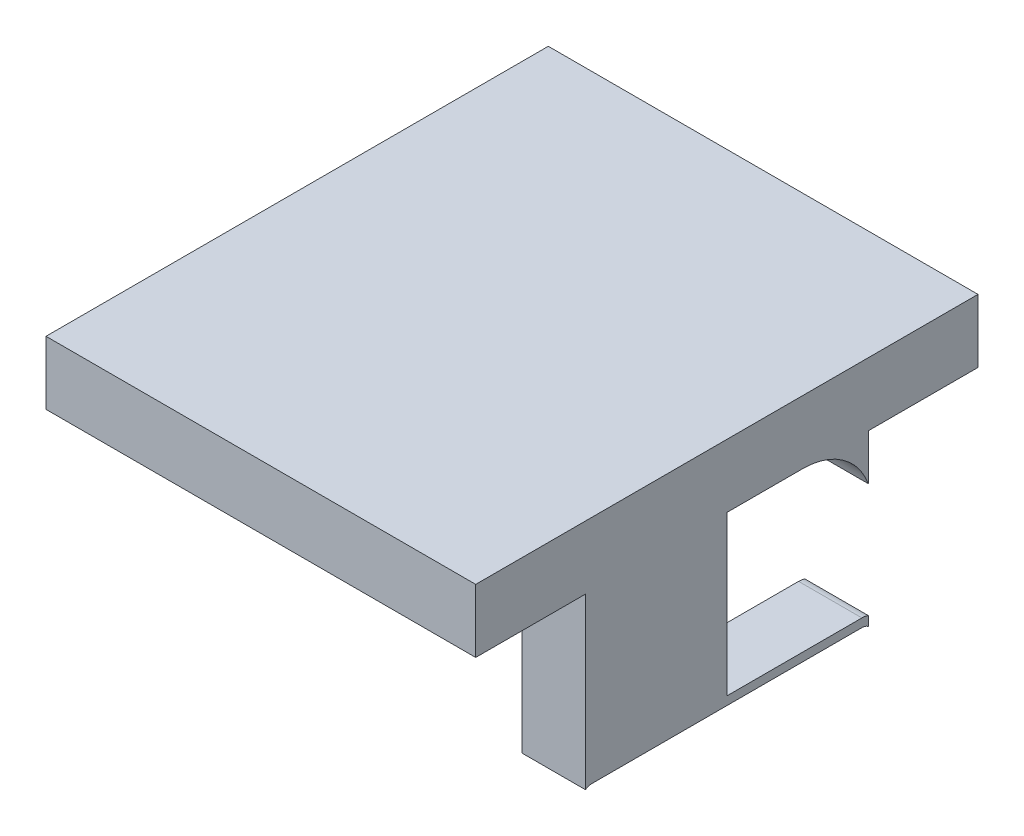
ISO-10303-21;
HEADER;
FILE_DESCRIPTION(('STEP AP214'),'2;1');
FILE_NAME('part.step','',(''),(''),'','','');
FILE_SCHEMA(('AUTOMOTIVE_DESIGN { 1 0 10303 214 1 1 1 1 }'));
ENDSEC;
DATA;
#1=APPLICATION_CONTEXT('core data for automotive mechanical design processes');
#2=APPLICATION_PROTOCOL_DEFINITION('international standard','automotive_design',2000,#1);
#3=PRODUCT_CONTEXT('',#1,'mechanical');
#4=PRODUCT('Part','Part','',(#3));
#5=PRODUCT_RELATED_PRODUCT_CATEGORY('part','',(#4));
#6=PRODUCT_DEFINITION_FORMATION('','',#4);
#7=PRODUCT_DEFINITION_CONTEXT('part definition',#1,'design');
#8=PRODUCT_DEFINITION('design','',#6,#7);
#9=PRODUCT_DEFINITION_SHAPE('','',#8);
#10=(LENGTH_UNIT() NAMED_UNIT(*) SI_UNIT(.MILLI.,.METRE.));
#11=(NAMED_UNIT(*) PLANE_ANGLE_UNIT() SI_UNIT($,.RADIAN.));
#12=(NAMED_UNIT(*) SI_UNIT($,.STERADIAN.) SOLID_ANGLE_UNIT());
#13=UNCERTAINTY_MEASURE_WITH_UNIT(LENGTH_MEASURE(1.E-05),#10,'distance_accuracy_value','');
#14=(GEOMETRIC_REPRESENTATION_CONTEXT(3) GLOBAL_UNCERTAINTY_ASSIGNED_CONTEXT((#13)) GLOBAL_UNIT_ASSIGNED_CONTEXT((#10,
#11,#12)) REPRESENTATION_CONTEXT('',''));
#15=CARTESIAN_POINT('',(0.,0.,0.));
#16=DIRECTION('',(0.,0.,1.));
#17=DIRECTION('',(1.,0.,0.));
#18=AXIS2_PLACEMENT_3D('',#15,#16,#17);
#19=CARTESIAN_POINT('',(-172.469724021272,-66.6233671005223,0.));
#20=DIRECTION('',(0.,1.,0.));
#21=DIRECTION('',(0.,0.,1.));
#22=AXIS2_PLACEMENT_3D('',#19,#20,#21);
#23=PLANE('',#22);
#24=DIRECTION('',(-1.,0.,0.));
#25=VECTOR('',#24,1.);
#26=CARTESIAN_POINT('',(5.4091140287146E-13,-66.6233671005223,-32.4806452321634));
#27=LINE('',#26,#25);
#28=CARTESIAN_POINT('',(-164.684562907065,-66.6233671005223,-32.4806452321661));
#29=VERTEX_POINT('',#28);
#30=CARTESIAN_POINT('',(-167.184562907065,-66.6233671005223,-32.4806452321661));
#31=VERTEX_POINT('',#30);
#32=EDGE_CURVE('E232',#29,#31,#27,.T.);
#33=ORIENTED_EDGE('',*,*,#32,.F.);
#34=DIRECTION('',(0.,0.,1.));
#35=VECTOR('',#34,1.);
#36=CARTESIAN_POINT('',(-164.684562907065,-66.6233671005223,0.));
#37=LINE('',#36,#35);
#38=CARTESIAN_POINT('',(-164.684562907065,-66.6233671005223,-33.4806452321661));
#39=VERTEX_POINT('',#38);
#40=EDGE_CURVE('E245',#39,#29,#37,.T.);
#41=ORIENTED_EDGE('',*,*,#40,.F.);
#42=DIRECTION('',(1.,0.,0.));
#43=VECTOR('',#42,1.);
#44=CARTESIAN_POINT('',(0.,-66.6233671005223,-33.4806452321661));
#45=LINE('',#44,#43);
#46=CARTESIAN_POINT('',(-166.184562907065,-66.6233671005223,-33.4806452321661));
#47=VERTEX_POINT('',#46);
#48=EDGE_CURVE('E264',#47,#39,#45,.T.);
#49=ORIENTED_EDGE('',*,*,#48,.F.);
#50=DIRECTION('',(0.,0.,1.));
#51=VECTOR('',#50,1.);
#52=CARTESIAN_POINT('',(-166.184562907065,-66.6233671005223,0.));
#53=LINE('',#52,#51);
#54=CARTESIAN_POINT('',(-166.184562907065,-66.6233671005223,-34.9806452321661));
#55=VERTEX_POINT('',#54);
#56=EDGE_CURVE('E261',#55,#47,#53,.T.);
#57=ORIENTED_EDGE('',*,*,#56,.F.);
#58=DIRECTION('',(1.,0.,0.));
#59=VECTOR('',#58,1.);
#60=CARTESIAN_POINT('',(0.,-66.6233671005223,-34.9806452321661));
#61=LINE('',#60,#59);
#62=CARTESIAN_POINT('',(-167.184562907065,-66.6233671005223,-34.9806452321661));
#63=VERTEX_POINT('',#62);
#64=EDGE_CURVE('E258',#63,#55,#61,.T.);
#65=ORIENTED_EDGE('',*,*,#64,.F.);
#66=DIRECTION('',(0.,0.,-1.));
#67=VECTOR('',#66,1.);
#68=CARTESIAN_POINT('',(-167.184562907065,-66.6233671005223,0.));
#69=LINE('',#68,#67);
#70=EDGE_CURVE('E235',#31,#63,#69,.T.);
#71=ORIENTED_EDGE('',*,*,#70,.F.);
#72=EDGE_LOOP('',(#33,#41,#49,#57,#65,#71));
#73=FACE_BOUND('',#72,.T.);
#74=DIRECTION('',(1.,0.,0.));
#75=VECTOR('',#74,1.);
#76=CARTESIAN_POINT('',(-172.469724021272,-66.6233671005223,-30.8806452321661));
#77=LINE('',#76,#75);
#78=CARTESIAN_POINT('',(-168.034562907065,-66.6233671005223,-30.8806452321661));
#79=VERTEX_POINT('',#78);
#80=CARTESIAN_POINT('',(-157.854562907065,-66.6233671005223,-30.8806452321661));
#81=VERTEX_POINT('',#80);
#82=EDGE_CURVE('E317',#79,#81,#77,.T.);
#83=ORIENTED_EDGE('',*,*,#82,.F.);
#84=DIRECTION('',(0.,0.,1.));
#85=VECTOR('',#84,1.);
#86=CARTESIAN_POINT('',(-168.034562907065,-66.6233671005223,0.));
#87=LINE('',#86,#85);
#88=CARTESIAN_POINT('',(-168.034562907065,-66.6233671005223,-42.7806452321661));
#89=VERTEX_POINT('',#88);
#90=EDGE_CURVE('E286',#89,#79,#87,.T.);
#91=ORIENTED_EDGE('',*,*,#90,.F.);
#92=DIRECTION('',(1.,0.,0.));
#93=VECTOR('',#92,1.);
#94=CARTESIAN_POINT('',(-172.469724021272,-66.6233671005223,-42.7806452321661));
#95=LINE('',#94,#93);
#96=CARTESIAN_POINT('',(-157.854562907065,-66.6233671005223,-42.7806452321661));
#97=VERTEX_POINT('',#96);
#98=EDGE_CURVE('E391',#89,#97,#95,.T.);
#99=ORIENTED_EDGE('',*,*,#98,.T.);
#100=DIRECTION('',(0.,0.,1.));
#101=VECTOR('',#100,1.);
#102=CARTESIAN_POINT('',(-157.854562907065,-66.6233671005223,0.));
#103=LINE('',#102,#101);
#104=CARTESIAN_POINT('',(-157.854562907065,-66.6233671005223,-40.1806452321661));
#105=VERTEX_POINT('',#104);
#106=EDGE_CURVE('E339',#97,#105,#103,.T.);
#107=ORIENTED_EDGE('',*,*,#106,.T.);
#108=DIRECTION('',(1.,0.,0.));
#109=VECTOR('',#108,1.);
#110=CARTESIAN_POINT('',(-172.469724021272,-66.6233671005223,-40.1806452321661));
#111=LINE('',#110,#109);
#112=CARTESIAN_POINT('',(-159.354562907065,-66.6233671005223,-40.1806452321661));
#113=VERTEX_POINT('',#112);
#114=EDGE_CURVE('E329',#113,#105,#111,.T.);
#115=ORIENTED_EDGE('',*,*,#114,.F.);
#116=DIRECTION('',(0.,0.,-1.));
#117=VECTOR('',#116,1.);
#118=CARTESIAN_POINT('',(-159.354562907065,-66.6233671005223,12.0823331861834));
#119=LINE('',#118,#117);
#120=CARTESIAN_POINT('',(-159.354562907065,-66.6233671005223,-38.6306452321661));
#121=VERTEX_POINT('',#120);
#122=EDGE_CURVE('E43',#121,#113,#119,.T.);
#123=ORIENTED_EDGE('',*,*,#122,.F.);
#124=DIRECTION('',(1.,0.,0.));
#125=VECTOR('',#124,1.);
#126=CARTESIAN_POINT('',(-172.469724021272,-66.6233671005223,-38.6306452321661));
#127=LINE('',#126,#125);
#128=CARTESIAN_POINT('',(-157.854562907065,-66.6233671005223,-38.6306452321661));
#129=VERTEX_POINT('',#128);
#130=EDGE_CURVE('E333',#121,#129,#127,.T.);
#131=ORIENTED_EDGE('',*,*,#130,.T.);
#132=CARTESIAN_POINT('',(-157.854562907065,-66.6233671005223,-36.8306452321661));
#133=VERTEX_POINT('',#132);
#134=EDGE_CURVE('E334',#129,#133,#103,.T.);
#135=ORIENTED_EDGE('',*,*,#134,.T.);
#136=DIRECTION('',(1.,0.,0.));
#137=VECTOR('',#136,1.);
#138=CARTESIAN_POINT('',(-172.469724021272,-66.6233671005223,-36.8306452321661));
#139=LINE('',#138,#137);
#140=CARTESIAN_POINT('',(-159.354562907065,-66.6233671005223,-36.8306452321661));
#141=VERTEX_POINT('',#140);
#142=EDGE_CURVE('E337',#141,#133,#139,.T.);
#143=ORIENTED_EDGE('',*,*,#142,.F.);
#144=CARTESIAN_POINT('',(-159.354562907065,-66.6233671005223,-33.4806452321661));
#145=VERTEX_POINT('',#144);
#146=EDGE_CURVE('E11',#145,#141,#119,.T.);
#147=ORIENTED_EDGE('',*,*,#146,.F.);
#148=DIRECTION('',(1.,0.,0.));
#149=VECTOR('',#148,1.);
#150=CARTESIAN_POINT('',(-172.469724021272,-66.6233671005223,-33.4806452321661));
#151=LINE('',#150,#149);
#152=CARTESIAN_POINT('',(-157.854562907065,-66.6233671005223,-33.4806452321661));
#153=VERTEX_POINT('',#152);
#154=EDGE_CURVE('E386',#145,#153,#151,.T.);
#155=ORIENTED_EDGE('',*,*,#154,.T.);
#156=EDGE_CURVE('E338',#153,#81,#103,.T.);
#157=ORIENTED_EDGE('',*,*,#156,.T.);
#158=EDGE_LOOP('',(#83,#91,#99,#107,#115,#123,#131,#135,#143,#147,#155,#157));
#159=FACE_BOUND('',#158,.T.);
#160=DIRECTION('',(1.,0.,0.));
#161=VECTOR('',#160,1.);
#162=CARTESIAN_POINT('',(-1.1429925126418E-13,-66.6233671005223,-41.1806452321666));
#163=LINE('',#162,#161);
#164=CARTESIAN_POINT('',(-161.954562907065,-66.6233671005223,-41.1806452321662));
#165=VERTEX_POINT('',#164);
#166=CARTESIAN_POINT('',(-159.354562907065,-66.6233671005223,-41.1806452321662));
#167=VERTEX_POINT('',#166);
#168=EDGE_CURVE('E231',#165,#167,#163,.T.);
#169=ORIENTED_EDGE('',*,*,#168,.F.);
#170=DIRECTION('',(0.,0.,-1.));
#171=VECTOR('',#170,1.);
#172=CARTESIAN_POINT('',(-161.954562907065,-66.6233671005223,0.));
#173=LINE('',#172,#171);
#174=CARTESIAN_POINT('',(-161.954562907065,-66.6233671005223,-40.2806452321661));
#175=VERTEX_POINT('',#174);
#176=EDGE_CURVE('E228',#175,#165,#173,.T.);
#177=ORIENTED_EDGE('',*,*,#176,.F.);
#178=DIRECTION('',(-1.,0.,0.));
#179=VECTOR('',#178,1.);
#180=CARTESIAN_POINT('',(0.,-66.6233671005223,-40.2806452321661));
#181=LINE('',#180,#179);
#182=CARTESIAN_POINT('',(-159.354562907065,-66.6233671005223,-40.2806452321661));
#183=VERTEX_POINT('',#182);
#184=EDGE_CURVE('E59',#183,#175,#181,.T.);
#185=ORIENTED_EDGE('',*,*,#184,.F.);
#186=DIRECTION('',(0.,0.,1.));
#187=VECTOR('',#186,1.);
#188=CARTESIAN_POINT('',(-159.354562907065,-66.6233671005223,0.));
#189=LINE('',#188,#187);
#190=EDGE_CURVE('E54',#167,#183,#189,.T.);
#191=ORIENTED_EDGE('',*,*,#190,.F.);
#192=EDGE_LOOP('',(#169,#177,#185,#191));
#193=FACE_BOUND('',#192,.T.);
#194=ADVANCED_FACE('F39',(#73,#159,#193),#23,.F.);
#195=CARTESIAN_POINT('',(-159.354562907065,-18.3232666768886,12.0823331861834));
#196=DIRECTION('',(-1.,0.,0.));
#197=DIRECTION('',(0.,0.,1.));
#198=AXIS2_PLACEMENT_3D('',#195,#196,#197);
#199=PLANE('',#198);
#200=DIRECTION('',(0.,-1.,0.));
#201=VECTOR('',#200,1.);
#202=CARTESIAN_POINT('',(-159.354562907065,0.,-33.4806452321661));
#203=LINE('',#202,#201);
#204=CARTESIAN_POINT('',(-159.354562907065,-70.6367554463235,-33.4806452321661));
#205=VERTEX_POINT('',#204);
#206=EDGE_CURVE('E307',#145,#205,#203,.T.);
#207=ORIENTED_EDGE('',*,*,#206,.F.);
#208=ORIENTED_EDGE('',*,*,#146,.T.);
#209=DIRECTION('',(0.,-1.,0.));
#210=VECTOR('',#209,1.);
#211=CARTESIAN_POINT('',(-159.354562907065,0.,-36.8306452321661));
#212=LINE('',#211,#210);
#213=CARTESIAN_POINT('',(-159.354562907065,-70.3867554463235,-36.8306452321661));
#214=VERTEX_POINT('',#213);
#215=EDGE_CURVE('E361',#141,#214,#212,.T.);
#216=ORIENTED_EDGE('',*,*,#215,.T.);
#217=DIRECTION('',(0.,0.,1.));
#218=VECTOR('',#217,1.);
#219=CARTESIAN_POINT('',(-159.354562907065,-70.3867554463234,1.52626946338219E-13));
#220=LINE('',#219,#218);
#221=CARTESIAN_POINT('',(-159.354562907065,-70.3867554463235,-40.0306452321661));
#222=VERTEX_POINT('',#221);
#223=EDGE_CURVE('E343',#222,#214,#220,.T.);
#224=ORIENTED_EDGE('',*,*,#223,.F.);
#225=CARTESIAN_POINT('',(-159.354562907065,-70.8367554463235,-40.0306452321661));
#226=DIRECTION('',(-1.,0.,0.));
#227=DIRECTION('',(0.,0.,1.));
#228=AXIS2_PLACEMENT_3D('',#225,#226,#227);
#229=CIRCLE('',#228,0.449999999999996);
#230=CARTESIAN_POINT('',(-159.354562907065,-70.4124913776115,-40.1806452321661));
#231=VERTEX_POINT('',#230);
#232=EDGE_CURVE('E356',#231,#222,#229,.F.);
#233=ORIENTED_EDGE('',*,*,#232,.F.);
#234=DIRECTION('',(0.,-1.,0.));
#235=VECTOR('',#234,1.);
#236=CARTESIAN_POINT('',(-159.354562907065,0.,-40.1806452321661));
#237=LINE('',#236,#235);
#238=CARTESIAN_POINT('',(-159.354562907065,-70.6367554463235,-40.1806452321661));
#239=VERTEX_POINT('',#238);
#240=EDGE_CURVE('E311',#231,#239,#237,.T.);
#241=ORIENTED_EDGE('',*,*,#240,.T.);
#242=CARTESIAN_POINT('',(-159.354562907065,-70.8367554463235,-40.0306452321661));
#243=DIRECTION('',(-1.,0.,0.));
#244=DIRECTION('',(0.,0.,1.));
#245=AXIS2_PLACEMENT_3D('',#242,#243,#244);
#246=CIRCLE('',#245,0.25);
#247=CARTESIAN_POINT('',(-159.354562907065,-70.5867554463235,-40.0306452321661));
#248=VERTEX_POINT('',#247);
#249=EDGE_CURVE('E378',#239,#248,#246,.F.);
#250=ORIENTED_EDGE('',*,*,#249,.T.);
#251=DIRECTION('',(0.,0.,1.));
#252=VECTOR('',#251,1.);
#253=CARTESIAN_POINT('',(-159.354562907065,-70.5867554463235,0.));
#254=LINE('',#253,#252);
#255=CARTESIAN_POINT('',(-159.354562907065,-70.5867554463235,-33.6306452321661));
#256=VERTEX_POINT('',#255);
#257=EDGE_CURVE('E375',#248,#256,#254,.T.);
#258=ORIENTED_EDGE('',*,*,#257,.T.);
#259=CARTESIAN_POINT('',(-159.354562907065,-70.8367554463235,-33.6306452321661));
#260=DIRECTION('',(-1.,0.,0.));
#261=DIRECTION('',(0.,0.,1.));
#262=AXIS2_PLACEMENT_3D('',#259,#260,#261);
#263=CIRCLE('',#262,0.249999999999993);
#264=EDGE_CURVE('E370',#256,#205,#263,.F.);
#265=ORIENTED_EDGE('',*,*,#264,.T.);
#266=EDGE_LOOP('',(#207,#208,#216,#224,#233,#241,#250,#258,#265));
#267=FACE_BOUND('',#266,.T.);
#268=ADVANCED_FACE('F41',(#267),#199,.T.);
#269=CARTESIAN_POINT('',(-159.354562907065,-68.2733671005223,-38.6306452321661));
#270=DIRECTION('',(-1.,0.,0.));
#271=DIRECTION('',(0.,0.,1.));
#272=AXIS2_PLACEMENT_3D('',#269,#270,#271);
#273=CIRCLE('',#272,1.65);
#274=CARTESIAN_POINT('',(-159.354562907065,-67.707681675573,-40.1806452321661));
#275=VERTEX_POINT('',#274);
#276=EDGE_CURVE('E364',#275,#121,#273,.F.);
#277=ORIENTED_EDGE('',*,*,#276,.T.);
#278=ORIENTED_EDGE('',*,*,#122,.T.);
#279=DIRECTION('',(0.,-1.,0.));
#280=VECTOR('',#279,1.);
#281=CARTESIAN_POINT('',(-159.354562907065,0.,-40.1806452321661));
#282=LINE('',#281,#280);
#283=EDGE_CURVE('E367',#113,#275,#282,.T.);
#284=ORIENTED_EDGE('',*,*,#283,.T.);
#285=EDGE_LOOP('',(#277,#278,#284));
#286=FACE_BOUND('',#285,.T.);
#287=ADVANCED_FACE('F479',(#286),#199,.T.);
#288=CARTESIAN_POINT('',(-172.469724021272,-70.8367554463235,-40.0306452321661));
#289=DIRECTION('',(1.,0.,0.));
#290=DIRECTION('',(0.,0.,-1.));
#291=AXIS2_PLACEMENT_3D('',#288,#289,#290);
#292=CYLINDRICAL_SURFACE('',#291,0.25);
#293=ORIENTED_EDGE('',*,*,#249,.F.);
#294=DIRECTION('',(1.,0.,0.));
#295=VECTOR('',#294,1.);
#296=CARTESIAN_POINT('',(-172.469724021272,-70.6367554463235,-40.1806452321661));
#297=LINE('',#296,#295);
#298=CARTESIAN_POINT('',(-157.854562907065,-70.6367554463235,-40.1806452321661));
#299=VERTEX_POINT('',#298);
#300=EDGE_CURVE('E290',#239,#299,#297,.T.);
#301=ORIENTED_EDGE('',*,*,#300,.T.);
#302=CARTESIAN_POINT('',(-157.854562907065,-70.8367554463235,-40.0306452321661));
#303=DIRECTION('',(1.,0.,0.));
#304=DIRECTION('',(0.,0.,-1.));
#305=AXIS2_PLACEMENT_3D('',#302,#303,#304);
#306=CIRCLE('',#305,0.25);
#307=CARTESIAN_POINT('',(-157.854562907065,-70.5867554463235,-40.0306452321661));
#308=VERTEX_POINT('',#307);
#309=EDGE_CURVE('E353',#299,#308,#306,.T.);
#310=ORIENTED_EDGE('',*,*,#309,.T.);
#311=DIRECTION('',(1.,0.,0.));
#312=VECTOR('',#311,1.);
#313=CARTESIAN_POINT('',(-172.469724021272,-70.5867554463235,-40.0306452321661));
#314=LINE('',#313,#312);
#315=EDGE_CURVE('E303',#248,#308,#314,.T.);
#316=ORIENTED_EDGE('',*,*,#315,.F.);
#317=EDGE_LOOP('',(#293,#301,#310,#316));
#318=FACE_BOUND('',#317,.T.);
#319=ADVANCED_FACE('F401',(#318),#292,.F.);
#320=CARTESIAN_POINT('',(-172.469724021272,-70.5867554463235,0.));
#321=DIRECTION('',(0.,1.,0.));
#322=DIRECTION('',(0.,0.,1.));
#323=AXIS2_PLACEMENT_3D('',#320,#321,#322);
#324=PLANE('',#323);
#325=ORIENTED_EDGE('',*,*,#257,.F.);
#326=ORIENTED_EDGE('',*,*,#315,.T.);
#327=DIRECTION('',(0.,0.,1.));
#328=VECTOR('',#327,1.);
#329=CARTESIAN_POINT('',(-157.854562907065,-70.5867554463235,0.));
#330=LINE('',#329,#328);
#331=CARTESIAN_POINT('',(-157.854562907065,-70.5867554463235,-33.6306452321661));
#332=VERTEX_POINT('',#331);
#333=EDGE_CURVE('E299',#308,#332,#330,.T.);
#334=ORIENTED_EDGE('',*,*,#333,.T.);
#335=DIRECTION('',(1.,0.,0.));
#336=VECTOR('',#335,1.);
#337=CARTESIAN_POINT('',(-172.469724021272,-70.5867554463235,-33.6306452321661));
#338=LINE('',#337,#336);
#339=EDGE_CURVE('E302',#256,#332,#338,.T.);
#340=ORIENTED_EDGE('',*,*,#339,.F.);
#341=EDGE_LOOP('',(#325,#326,#334,#340));
#342=FACE_BOUND('',#341,.T.);
#343=ADVANCED_FACE('F416',(#342),#324,.F.);
#344=CARTESIAN_POINT('',(-172.469724021272,-70.8367554463235,-33.6306452321661));
#345=DIRECTION('',(1.,0.,0.));
#346=DIRECTION('',(0.,0.,-1.));
#347=AXIS2_PLACEMENT_3D('',#344,#345,#346);
#348=CYLINDRICAL_SURFACE('',#347,0.249999999999993);
#349=ORIENTED_EDGE('',*,*,#264,.F.);
#350=ORIENTED_EDGE('',*,*,#339,.T.);
#351=CARTESIAN_POINT('',(-157.854562907065,-70.8367554463235,-33.6306452321661));
#352=DIRECTION('',(1.,0.,0.));
#353=DIRECTION('',(0.,0.,-1.));
#354=AXIS2_PLACEMENT_3D('',#351,#352,#353);
#355=CIRCLE('',#354,0.249999999999993);
#356=CARTESIAN_POINT('',(-157.854562907065,-70.6367554463235,-33.4806452321661));
#357=VERTEX_POINT('',#356);
#358=EDGE_CURVE('E304',#332,#357,#355,.T.);
#359=ORIENTED_EDGE('',*,*,#358,.T.);
#360=DIRECTION('',(1.,0.,0.));
#361=VECTOR('',#360,1.);
#362=CARTESIAN_POINT('',(-172.469724021272,-70.6367554463235,-33.4806452321661));
#363=LINE('',#362,#361);
#364=EDGE_CURVE('E372',#205,#357,#363,.T.);
#365=ORIENTED_EDGE('',*,*,#364,.F.);
#366=EDGE_LOOP('',(#349,#350,#359,#365));
#367=FACE_BOUND('',#366,.T.);
#368=ADVANCED_FACE('F626',(#367),#348,.F.);
#369=CARTESIAN_POINT('',(-172.469724021272,0.,-33.4806452321661));
#370=DIRECTION('',(0.,0.,1.));
#371=DIRECTION('',(1.,0.,0.));
#372=AXIS2_PLACEMENT_3D('',#369,#370,#371);
#373=PLANE('',#372);
#374=ORIENTED_EDGE('',*,*,#154,.F.);
#375=ORIENTED_EDGE('',*,*,#206,.T.);
#376=ORIENTED_EDGE('',*,*,#364,.T.);
#377=DIRECTION('',(0.,-1.,0.));
#378=VECTOR('',#377,1.);
#379=CARTESIAN_POINT('',(-157.854562907065,0.,-33.4806452321661));
#380=LINE('',#379,#378);
#381=EDGE_CURVE('E308',#153,#357,#380,.T.);
#382=ORIENTED_EDGE('',*,*,#381,.F.);
#383=EDGE_LOOP('',(#374,#375,#376,#382));
#384=FACE_BOUND('',#383,.T.);
#385=ADVANCED_FACE('F631',(#384),#373,.T.);
#386=CARTESIAN_POINT('',(-172.469724021272,0.,-30.8806452321661));
#387=DIRECTION('',(0.,0.,-1.));
#388=DIRECTION('',(-1.,0.,0.));
#389=AXIS2_PLACEMENT_3D('',#386,#387,#388);
#390=PLANE('',#389);
#391=DIRECTION('',(1.,0.,0.));
#392=VECTOR('',#391,1.);
#393=CARTESIAN_POINT('',(-172.469724021272,-65.1233671005223,-30.8806452321661));
#394=LINE('',#393,#392);
#395=CARTESIAN_POINT('',(-168.034562907065,-65.1233671005223,-30.8806452321661));
#396=VERTEX_POINT('',#395);
#397=CARTESIAN_POINT('',(-157.854562907065,-65.1233671005223,-30.8806452321661));
#398=VERTEX_POINT('',#397);
#399=EDGE_CURVE('E316',#396,#398,#394,.T.);
#400=ORIENTED_EDGE('',*,*,#399,.F.);
#401=DIRECTION('',(0.,1.,0.));
#402=VECTOR('',#401,1.);
#403=CARTESIAN_POINT('',(-168.034562907065,0.,-30.8806452321661));
#404=LINE('',#403,#402);
#405=EDGE_CURVE('E294',#79,#396,#404,.T.);
#406=ORIENTED_EDGE('',*,*,#405,.F.);
#407=ORIENTED_EDGE('',*,*,#82,.T.);
#408=DIRECTION('',(0.,1.,0.));
#409=VECTOR('',#408,1.);
#410=CARTESIAN_POINT('',(-157.854562907065,0.,-30.8806452321661));
#411=LINE('',#410,#409);
#412=EDGE_CURVE('E313',#81,#398,#411,.T.);
#413=ORIENTED_EDGE('',*,*,#412,.T.);
#414=EDGE_LOOP('',(#400,#406,#407,#413));
#415=FACE_BOUND('',#414,.T.);
#416=ADVANCED_FACE('F455',(#415),#390,.F.);
#417=CARTESIAN_POINT('',(-172.469724021272,-65.1233671005223,0.));
#418=DIRECTION('',(0.,-1.,0.));
#419=DIRECTION('',(0.,0.,-1.));
#420=AXIS2_PLACEMENT_3D('',#417,#418,#419);
#421=PLANE('',#420);
#422=DIRECTION('',(1.,0.,0.));
#423=VECTOR('',#422,1.);
#424=CARTESIAN_POINT('',(-172.469724021272,-65.1233671005223,-42.7806452321661));
#425=LINE('',#424,#423);
#426=CARTESIAN_POINT('',(-168.034562907065,-65.1233671005223,-42.7806452321661));
#427=VERTEX_POINT('',#426);
#428=CARTESIAN_POINT('',(-157.854562907065,-65.1233671005223,-42.7806452321661));
#429=VERTEX_POINT('',#428);
#430=EDGE_CURVE('E321',#427,#429,#425,.T.);
#431=ORIENTED_EDGE('',*,*,#430,.F.);
#432=DIRECTION('',(0.,0.,-1.));
#433=VECTOR('',#432,1.);
#434=CARTESIAN_POINT('',(-168.034562907065,-65.1233671005223,0.));
#435=LINE('',#434,#433);
#436=EDGE_CURVE('E291',#396,#427,#435,.T.);
#437=ORIENTED_EDGE('',*,*,#436,.F.);
#438=ORIENTED_EDGE('',*,*,#399,.T.);
#439=DIRECTION('',(0.,0.,-1.));
#440=VECTOR('',#439,1.);
#441=CARTESIAN_POINT('',(-157.854562907065,-65.1233671005223,0.));
#442=LINE('',#441,#440);
#443=EDGE_CURVE('E318',#398,#429,#442,.T.);
#444=ORIENTED_EDGE('',*,*,#443,.T.);
#445=EDGE_LOOP('',(#431,#437,#438,#444));
#446=FACE_BOUND('',#445,.T.);
#447=ADVANCED_FACE('F462',(#446),#421,.F.);
#448=CARTESIAN_POINT('',(-172.469724021272,0.,-42.7806452321661));
#449=DIRECTION('',(0.,0.,-1.));
#450=DIRECTION('',(-1.,0.,0.));
#451=AXIS2_PLACEMENT_3D('',#448,#449,#450);
#452=PLANE('',#451);
#453=ORIENTED_EDGE('',*,*,#98,.F.);
#454=DIRECTION('',(0.,1.,0.));
#455=VECTOR('',#454,1.);
#456=CARTESIAN_POINT('',(-168.034562907065,0.,-42.7806452321661));
#457=LINE('',#456,#455);
#458=EDGE_CURVE('E287',#89,#427,#457,.T.);
#459=ORIENTED_EDGE('',*,*,#458,.T.);
#460=ORIENTED_EDGE('',*,*,#430,.T.);
#461=DIRECTION('',(0.,1.,0.));
#462=VECTOR('',#461,1.);
#463=CARTESIAN_POINT('',(-157.854562907065,0.,-42.7806452321661));
#464=LINE('',#463,#462);
#465=EDGE_CURVE('E312',#97,#429,#464,.T.);
#466=ORIENTED_EDGE('',*,*,#465,.F.);
#467=EDGE_LOOP('',(#453,#459,#460,#466));
#468=FACE_BOUND('',#467,.T.);
#469=ADVANCED_FACE('F464',(#468),#452,.T.);
#470=CARTESIAN_POINT('',(-172.469724021272,0.,-40.1806452321661));
#471=DIRECTION('',(0.,0.,1.));
#472=DIRECTION('',(1.,0.,0.));
#473=AXIS2_PLACEMENT_3D('',#470,#471,#472);
#474=PLANE('',#473);
#475=ORIENTED_EDGE('',*,*,#283,.F.);
#476=ORIENTED_EDGE('',*,*,#114,.T.);
#477=DIRECTION('',(0.,-1.,0.));
#478=VECTOR('',#477,1.);
#479=CARTESIAN_POINT('',(-157.854562907065,0.,-40.1806452321661));
#480=LINE('',#479,#478);
#481=CARTESIAN_POINT('',(-157.854562907065,-67.707681675573,-40.1806452321661));
#482=VERTEX_POINT('',#481);
#483=EDGE_CURVE('E325',#105,#482,#480,.T.);
#484=ORIENTED_EDGE('',*,*,#483,.T.);
#485=DIRECTION('',(1.,0.,0.));
#486=VECTOR('',#485,1.);
#487=CARTESIAN_POINT('',(-172.469724021272,-67.707681675573,-40.1806452321661));
#488=LINE('',#487,#486);
#489=EDGE_CURVE('E328',#275,#482,#488,.T.);
#490=ORIENTED_EDGE('',*,*,#489,.F.);
#491=EDGE_LOOP('',(#475,#476,#484,#490));
#492=FACE_BOUND('',#491,.T.);
#493=ADVANCED_FACE('F447',(#492),#474,.F.);
#494=CARTESIAN_POINT('',(-172.469724021272,-68.2733671005223,-38.6306452321661));
#495=DIRECTION('',(1.,0.,0.));
#496=DIRECTION('',(0.,0.,-1.));
#497=AXIS2_PLACEMENT_3D('',#494,#495,#496);
#498=CYLINDRICAL_SURFACE('',#497,1.65);
#499=ORIENTED_EDGE('',*,*,#276,.F.);
#500=ORIENTED_EDGE('',*,*,#489,.T.);
#501=CARTESIAN_POINT('',(-157.854562907065,-68.2733671005223,-38.6306452321661));
#502=DIRECTION('',(1.,0.,0.));
#503=DIRECTION('',(0.,0.,-1.));
#504=AXIS2_PLACEMENT_3D('',#501,#502,#503);
#505=CIRCLE('',#504,1.65);
#506=EDGE_CURVE('E330',#482,#129,#505,.T.);
#507=ORIENTED_EDGE('',*,*,#506,.T.);
#508=ORIENTED_EDGE('',*,*,#130,.F.);
#509=EDGE_LOOP('',(#499,#500,#507,#508));
#510=FACE_BOUND('',#509,.T.);
#511=ADVANCED_FACE('F439',(#510),#498,.F.);
#512=CARTESIAN_POINT('',(-172.469724021272,0.,-36.8306452321661));
#513=DIRECTION('',(0.,0.,1.));
#514=DIRECTION('',(1.,0.,0.));
#515=AXIS2_PLACEMENT_3D('',#512,#513,#514);
#516=PLANE('',#515);
#517=ORIENTED_EDGE('',*,*,#215,.F.);
#518=ORIENTED_EDGE('',*,*,#142,.T.);
#519=DIRECTION('',(0.,-1.,0.));
#520=VECTOR('',#519,1.);
#521=CARTESIAN_POINT('',(-157.854562907065,0.,-36.8306452321661));
#522=LINE('',#521,#520);
#523=CARTESIAN_POINT('',(-157.854562907065,-70.3867554463235,-36.8306452321661));
#524=VERTEX_POINT('',#523);
#525=EDGE_CURVE('E340',#133,#524,#522,.T.);
#526=ORIENTED_EDGE('',*,*,#525,.T.);
#527=DIRECTION('',(1.,0.,0.));
#528=VECTOR('',#527,1.);
#529=CARTESIAN_POINT('',(-172.469724021272,-70.3867554463235,-36.8306452321661));
#530=LINE('',#529,#528);
#531=EDGE_CURVE('E359',#214,#524,#530,.T.);
#532=ORIENTED_EDGE('',*,*,#531,.F.);
#533=EDGE_LOOP('',(#517,#518,#526,#532));
#534=FACE_BOUND('',#533,.T.);
#535=ADVANCED_FACE('F432',(#534),#516,.F.);
#536=CARTESIAN_POINT('',(-172.469724021272,-70.3867554463234,1.52626946338219E-13));
#537=DIRECTION('',(0.,1.,0.));
#538=DIRECTION('',(0.,0.,1.));
#539=AXIS2_PLACEMENT_3D('',#536,#537,#538);
#540=PLANE('',#539);
#541=DIRECTION('',(1.,0.,0.));
#542=VECTOR('',#541,1.);
#543=CARTESIAN_POINT('',(-172.469724021272,-70.3867554463235,-40.0306452321661));
#544=LINE('',#543,#542);
#545=CARTESIAN_POINT('',(-157.854562907065,-70.3867554463235,-40.0306452321661));
#546=VERTEX_POINT('',#545);
#547=EDGE_CURVE('E358',#222,#546,#544,.T.);
#548=ORIENTED_EDGE('',*,*,#547,.F.);
#549=ORIENTED_EDGE('',*,*,#223,.T.);
#550=ORIENTED_EDGE('',*,*,#531,.T.);
#551=DIRECTION('',(0.,0.,1.));
#552=VECTOR('',#551,1.);
#553=CARTESIAN_POINT('',(-157.854562907065,-70.3867554463234,1.52626946338219E-13));
#554=LINE('',#553,#552);
#555=EDGE_CURVE('E324',#546,#524,#554,.T.);
#556=ORIENTED_EDGE('',*,*,#555,.F.);
#557=EDGE_LOOP('',(#548,#549,#550,#556));
#558=FACE_BOUND('',#557,.T.);
#559=ADVANCED_FACE('F426',(#558),#540,.T.);
#560=CARTESIAN_POINT('',(-172.469724021272,-70.8367554463235,-40.0306452321661));
#561=DIRECTION('',(1.,0.,0.));
#562=DIRECTION('',(0.,0.,-1.));
#563=AXIS2_PLACEMENT_3D('',#560,#561,#562);
#564=CYLINDRICAL_SURFACE('',#563,0.449999999999996);
#565=DIRECTION('',(1.,0.,0.));
#566=VECTOR('',#565,1.);
#567=CARTESIAN_POINT('',(-172.469724021272,-70.4124913776115,-40.1806452321661));
#568=LINE('',#567,#566);
#569=CARTESIAN_POINT('',(-157.854562907065,-70.4124913776115,-40.1806452321661));
#570=VERTEX_POINT('',#569);
#571=EDGE_CURVE('E352',#231,#570,#568,.T.);
#572=ORIENTED_EDGE('',*,*,#571,.F.);
#573=ORIENTED_EDGE('',*,*,#232,.T.);
#574=ORIENTED_EDGE('',*,*,#547,.T.);
#575=CARTESIAN_POINT('',(-157.854562907065,-70.8367554463235,-40.0306452321661));
#576=DIRECTION('',(1.,0.,0.));
#577=DIRECTION('',(0.,0.,-1.));
#578=AXIS2_PLACEMENT_3D('',#575,#576,#577);
#579=CIRCLE('',#578,0.449999999999996);
#580=EDGE_CURVE('E346',#570,#546,#579,.T.);
#581=ORIENTED_EDGE('',*,*,#580,.F.);
#582=EDGE_LOOP('',(#572,#573,#574,#581));
#583=FACE_BOUND('',#582,.T.);
#584=ADVANCED_FACE('F423',(#583),#564,.T.);
#585=CARTESIAN_POINT('',(-172.469724021272,0.,-40.1806452321661));
#586=DIRECTION('',(0.,0.,1.));
#587=DIRECTION('',(1.,0.,0.));
#588=AXIS2_PLACEMENT_3D('',#585,#586,#587);
#589=PLANE('',#588);
#590=ORIENTED_EDGE('',*,*,#240,.F.);
#591=ORIENTED_EDGE('',*,*,#571,.T.);
#592=DIRECTION('',(0.,-1.,0.));
#593=VECTOR('',#592,1.);
#594=CARTESIAN_POINT('',(-157.854562907065,0.,-40.1806452321661));
#595=LINE('',#594,#593);
#596=EDGE_CURVE('E349',#570,#299,#595,.T.);
#597=ORIENTED_EDGE('',*,*,#596,.T.);
#598=ORIENTED_EDGE('',*,*,#300,.F.);
#599=EDGE_LOOP('',(#590,#591,#597,#598));
#600=FACE_BOUND('',#599,.T.);
#601=ADVANCED_FACE('F407',(#600),#589,.F.);
#602=CARTESIAN_POINT('',(-157.854562907065,0.,0.));
#603=DIRECTION('',(1.,0.,0.));
#604=DIRECTION('',(0.,0.,-1.));
#605=AXIS2_PLACEMENT_3D('',#602,#603,#604);
#606=PLANE('',#605);
#607=ORIENTED_EDGE('',*,*,#134,.F.);
#608=ORIENTED_EDGE('',*,*,#506,.F.);
#609=ORIENTED_EDGE('',*,*,#483,.F.);
#610=ORIENTED_EDGE('',*,*,#106,.F.);
#611=ORIENTED_EDGE('',*,*,#465,.T.);
#612=ORIENTED_EDGE('',*,*,#443,.F.);
#613=ORIENTED_EDGE('',*,*,#412,.F.);
#614=ORIENTED_EDGE('',*,*,#156,.F.);
#615=ORIENTED_EDGE('',*,*,#381,.T.);
#616=ORIENTED_EDGE('',*,*,#358,.F.);
#617=ORIENTED_EDGE('',*,*,#333,.F.);
#618=ORIENTED_EDGE('',*,*,#309,.F.);
#619=ORIENTED_EDGE('',*,*,#596,.F.);
#620=ORIENTED_EDGE('',*,*,#580,.T.);
#621=ORIENTED_EDGE('',*,*,#555,.T.);
#622=ORIENTED_EDGE('',*,*,#525,.F.);
#623=EDGE_LOOP('',(#607,#608,#609,#610,#611,#612,#613,#614,#615,#616,#617,#618,#619,#620,#621,#622));
#624=FACE_BOUND('',#623,.T.);
#625=ADVANCED_FACE('F412',(#624),#606,.T.);
#626=CARTESIAN_POINT('',(-168.034562907065,-108.2104113613,78.6693547678341));
#627=DIRECTION('',(-1.,0.,0.));
#628=DIRECTION('',(0.,0.,-1.));
#629=AXIS2_PLACEMENT_3D('',#626,#627,#628);
#630=PLANE('',#629);
#631=ORIENTED_EDGE('',*,*,#458,.F.);
#632=ORIENTED_EDGE('',*,*,#90,.T.);
#633=ORIENTED_EDGE('',*,*,#405,.T.);
#634=ORIENTED_EDGE('',*,*,#436,.T.);
#635=EDGE_LOOP('',(#631,#632,#633,#634));
#636=FACE_BOUND('',#635,.T.);
#637=ADVANCED_FACE('F460',(#636),#630,.T.);
#638=CARTESIAN_POINT('',(5.4091140287146E-13,-67.6233671005223,-32.4806452321634));
#639=DIRECTION('',(0.,0.,-1.));
#640=DIRECTION('',(-1.,0.,0.));
#641=AXIS2_PLACEMENT_3D('',#638,#639,#640);
#642=PLANE('',#641);
#643=ORIENTED_EDGE('',*,*,#32,.T.);
#644=DIRECTION('',(0.,1.,0.));
#645=VECTOR('',#644,1.);
#646=CARTESIAN_POINT('',(-167.184562907065,-67.6233671005223,-32.4806452321661));
#647=LINE('',#646,#645);
#648=CARTESIAN_POINT('',(-167.184562907065,-67.6233671005223,-32.4806452321661));
#649=VERTEX_POINT('',#648);
#650=EDGE_CURVE('E283',#649,#31,#647,.T.);
#651=ORIENTED_EDGE('',*,*,#650,.F.);
#652=DIRECTION('',(-1.,0.,0.));
#653=VECTOR('',#652,1.);
#654=CARTESIAN_POINT('',(5.4091140287146E-13,-67.6233671005223,-32.4806452321634));
#655=LINE('',#654,#653);
#656=CARTESIAN_POINT('',(-164.684562907065,-67.6233671005223,-32.4806452321661));
#657=VERTEX_POINT('',#656);
#658=EDGE_CURVE('E241',#657,#649,#655,.T.);
#659=ORIENTED_EDGE('',*,*,#658,.F.);
#660=DIRECTION('',(0.,1.,0.));
#661=VECTOR('',#660,1.);
#662=CARTESIAN_POINT('',(-164.684562907065,-67.6233671005223,-32.4806452321661));
#663=LINE('',#662,#661);
#664=EDGE_CURVE('E254',#657,#29,#663,.T.);
#665=ORIENTED_EDGE('',*,*,#664,.T.);
#666=EDGE_LOOP('',(#643,#651,#659,#665));
#667=FACE_BOUND('',#666,.T.);
#668=ADVANCED_FACE('F501',(#667),#642,.F.);
#669=CARTESIAN_POINT('',(-167.184562907065,-67.6233671005223,0.));
#670=DIRECTION('',(1.,0.,0.));
#671=DIRECTION('',(0.,0.,-1.));
#672=AXIS2_PLACEMENT_3D('',#669,#670,#671);
#673=PLANE('',#672);
#674=ORIENTED_EDGE('',*,*,#70,.T.);
#675=DIRECTION('',(0.,1.,0.));
#676=VECTOR('',#675,1.);
#677=CARTESIAN_POINT('',(-167.184562907065,-67.6233671005223,-34.9806452321661));
#678=LINE('',#677,#676);
#679=CARTESIAN_POINT('',(-167.184562907065,-67.6233671005223,-34.9806452321661));
#680=VERTEX_POINT('',#679);
#681=EDGE_CURVE('E280',#680,#63,#678,.T.);
#682=ORIENTED_EDGE('',*,*,#681,.F.);
#683=DIRECTION('',(0.,0.,-1.));
#684=VECTOR('',#683,1.);
#685=CARTESIAN_POINT('',(-167.184562907065,-67.6233671005223,0.));
#686=LINE('',#685,#684);
#687=EDGE_CURVE('E244',#649,#680,#686,.T.);
#688=ORIENTED_EDGE('',*,*,#687,.F.);
#689=ORIENTED_EDGE('',*,*,#650,.T.);
#690=EDGE_LOOP('',(#674,#682,#688,#689));
#691=FACE_BOUND('',#690,.T.);
#692=ADVANCED_FACE('F504',(#691),#673,.F.);
#693=CARTESIAN_POINT('',(0.,-67.6233671005223,-34.9806452321661));
#694=DIRECTION('',(0.,0.,1.));
#695=DIRECTION('',(1.,0.,0.));
#696=AXIS2_PLACEMENT_3D('',#693,#694,#695);
#697=PLANE('',#696);
#698=ORIENTED_EDGE('',*,*,#64,.T.);
#699=DIRECTION('',(0.,1.,0.));
#700=VECTOR('',#699,1.);
#701=CARTESIAN_POINT('',(-166.184562907065,-67.6233671005223,-34.9806452321661));
#702=LINE('',#701,#700);
#703=CARTESIAN_POINT('',(-166.184562907065,-67.6233671005223,-34.9806452321661));
#704=VERTEX_POINT('',#703);
#705=EDGE_CURVE('E277',#704,#55,#702,.T.);
#706=ORIENTED_EDGE('',*,*,#705,.F.);
#707=DIRECTION('',(1.,0.,0.));
#708=VECTOR('',#707,1.);
#709=CARTESIAN_POINT('',(0.,-67.6233671005223,-34.9806452321661));
#710=LINE('',#709,#708);
#711=EDGE_CURVE('E247',#680,#704,#710,.T.);
#712=ORIENTED_EDGE('',*,*,#711,.F.);
#713=ORIENTED_EDGE('',*,*,#681,.T.);
#714=EDGE_LOOP('',(#698,#706,#712,#713));
#715=FACE_BOUND('',#714,.T.);
#716=ADVANCED_FACE('F508',(#715),#697,.F.);
#717=CARTESIAN_POINT('',(-166.184562907065,-67.6233671005223,0.));
#718=DIRECTION('',(-1.,0.,0.));
#719=DIRECTION('',(0.,0.,1.));
#720=AXIS2_PLACEMENT_3D('',#717,#718,#719);
#721=PLANE('',#720);
#722=ORIENTED_EDGE('',*,*,#56,.T.);
#723=DIRECTION('',(0.,1.,0.));
#724=VECTOR('',#723,1.);
#725=CARTESIAN_POINT('',(-166.184562907065,-67.6233671005223,-33.4806452321661));
#726=LINE('',#725,#724);
#727=CARTESIAN_POINT('',(-166.184562907065,-67.6233671005223,-33.4806452321661));
#728=VERTEX_POINT('',#727);
#729=EDGE_CURVE('E274',#728,#47,#726,.T.);
#730=ORIENTED_EDGE('',*,*,#729,.F.);
#731=DIRECTION('',(0.,0.,1.));
#732=VECTOR('',#731,1.);
#733=CARTESIAN_POINT('',(-166.184562907065,-67.6233671005223,0.));
#734=LINE('',#733,#732);
#735=EDGE_CURVE('E249',#704,#728,#734,.T.);
#736=ORIENTED_EDGE('',*,*,#735,.F.);
#737=ORIENTED_EDGE('',*,*,#705,.T.);
#738=EDGE_LOOP('',(#722,#730,#736,#737));
#739=FACE_BOUND('',#738,.T.);
#740=ADVANCED_FACE('F512',(#739),#721,.F.);
#741=CARTESIAN_POINT('',(0.,-67.6233671005223,-33.4806452321661));
#742=DIRECTION('',(0.,0.,1.));
#743=DIRECTION('',(1.,0.,0.));
#744=AXIS2_PLACEMENT_3D('',#741,#742,#743);
#745=PLANE('',#744);
#746=ORIENTED_EDGE('',*,*,#48,.T.);
#747=DIRECTION('',(0.,1.,0.));
#748=VECTOR('',#747,1.);
#749=CARTESIAN_POINT('',(-164.684562907065,-67.6233671005223,-33.4806452321661));
#750=LINE('',#749,#748);
#751=CARTESIAN_POINT('',(-164.684562907065,-67.6233671005223,-33.4806452321661));
#752=VERTEX_POINT('',#751);
#753=EDGE_CURVE('E271',#752,#39,#750,.T.);
#754=ORIENTED_EDGE('',*,*,#753,.F.);
#755=DIRECTION('',(1.,0.,0.));
#756=VECTOR('',#755,1.);
#757=CARTESIAN_POINT('',(0.,-67.6233671005223,-33.4806452321661));
#758=LINE('',#757,#756);
#759=EDGE_CURVE('E251',#728,#752,#758,.T.);
#760=ORIENTED_EDGE('',*,*,#759,.F.);
#761=ORIENTED_EDGE('',*,*,#729,.T.);
#762=EDGE_LOOP('',(#746,#754,#760,#761));
#763=FACE_BOUND('',#762,.T.);
#764=ADVANCED_FACE('F516',(#763),#745,.F.);
#765=CARTESIAN_POINT('',(-164.684562907065,-67.6233671005223,0.));
#766=DIRECTION('',(-1.,0.,0.));
#767=DIRECTION('',(0.,0.,1.));
#768=AXIS2_PLACEMENT_3D('',#765,#766,#767);
#769=PLANE('',#768);
#770=ORIENTED_EDGE('',*,*,#40,.T.);
#771=ORIENTED_EDGE('',*,*,#664,.F.);
#772=DIRECTION('',(0.,0.,1.));
#773=VECTOR('',#772,1.);
#774=CARTESIAN_POINT('',(-164.684562907065,-67.6233671005223,0.));
#775=LINE('',#774,#773);
#776=EDGE_CURVE('E253',#752,#657,#775,.T.);
#777=ORIENTED_EDGE('',*,*,#776,.F.);
#778=ORIENTED_EDGE('',*,*,#753,.T.);
#779=EDGE_LOOP('',(#770,#771,#777,#778));
#780=FACE_BOUND('',#779,.T.);
#781=ADVANCED_FACE('F520',(#780),#769,.F.);
#782=CARTESIAN_POINT('',(0.,-67.6233671005223,0.));
#783=DIRECTION('',(0.,-1.,0.));
#784=DIRECTION('',(0.,0.,-1.));
#785=AXIS2_PLACEMENT_3D('',#782,#783,#784);
#786=PLANE('',#785);
#787=ORIENTED_EDGE('',*,*,#658,.T.);
#788=ORIENTED_EDGE('',*,*,#687,.T.);
#789=ORIENTED_EDGE('',*,*,#711,.T.);
#790=ORIENTED_EDGE('',*,*,#735,.T.);
#791=ORIENTED_EDGE('',*,*,#759,.T.);
#792=ORIENTED_EDGE('',*,*,#776,.T.);
#793=EDGE_LOOP('',(#787,#788,#789,#790,#791,#792));
#794=FACE_BOUND('',#793,.T.);
#795=ADVANCED_FACE('F524',(#794),#786,.T.);
#796=CARTESIAN_POINT('',(-1.1429925126418E-13,-67.6233671005223,-41.1806452321666));
#797=DIRECTION('',(0.,0.,1.));
#798=DIRECTION('',(1.,0.,0.));
#799=AXIS2_PLACEMENT_3D('',#796,#797,#798);
#800=PLANE('',#799);
#801=ORIENTED_EDGE('',*,*,#168,.T.);
#802=DIRECTION('',(0.,1.,0.));
#803=VECTOR('',#802,1.);
#804=CARTESIAN_POINT('',(-159.354562907065,-67.6233671005223,-41.1806452321662));
#805=LINE('',#804,#803);
#806=CARTESIAN_POINT('',(-159.354562907065,-67.6233671005223,-41.1806452321662));
#807=VERTEX_POINT('',#806);
#808=EDGE_CURVE('E212',#807,#167,#805,.T.);
#809=ORIENTED_EDGE('',*,*,#808,.F.);
#810=DIRECTION('',(1.,0.,0.));
#811=VECTOR('',#810,1.);
#812=CARTESIAN_POINT('',(-1.1429925126418E-13,-67.6233671005223,-41.1806452321666));
#813=LINE('',#812,#811);
#814=CARTESIAN_POINT('',(-161.954562907065,-67.6233671005223,-41.1806452321662));
#815=VERTEX_POINT('',#814);
#816=EDGE_CURVE('E219',#815,#807,#813,.T.);
#817=ORIENTED_EDGE('',*,*,#816,.F.);
#818=DIRECTION('',(0.,1.,0.));
#819=VECTOR('',#818,1.);
#820=CARTESIAN_POINT('',(-161.954562907065,-67.6233671005223,-41.1806452321662));
#821=LINE('',#820,#819);
#822=EDGE_CURVE('E856',#815,#165,#821,.T.);
#823=ORIENTED_EDGE('',*,*,#822,.T.);
#824=EDGE_LOOP('',(#801,#809,#817,#823));
#825=FACE_BOUND('',#824,.T.);
#826=ADVANCED_FACE('F230',(#825),#800,.F.);
#827=CARTESIAN_POINT('',(-159.354562907065,-67.6233671005223,0.));
#828=DIRECTION('',(-1.,0.,0.));
#829=DIRECTION('',(0.,0.,1.));
#830=AXIS2_PLACEMENT_3D('',#827,#828,#829);
#831=PLANE('',#830);
#832=ORIENTED_EDGE('',*,*,#190,.T.);
#833=DIRECTION('',(0.,1.,0.));
#834=VECTOR('',#833,1.);
#835=CARTESIAN_POINT('',(-159.354562907065,-67.6233671005223,-40.2806452321661));
#836=LINE('',#835,#834);
#837=CARTESIAN_POINT('',(-159.354562907065,-67.6233671005223,-40.2806452321661));
#838=VERTEX_POINT('',#837);
#839=EDGE_CURVE('E215',#838,#183,#836,.T.);
#840=ORIENTED_EDGE('',*,*,#839,.F.);
#841=DIRECTION('',(0.,0.,1.));
#842=VECTOR('',#841,1.);
#843=CARTESIAN_POINT('',(-159.354562907065,-67.6233671005223,0.));
#844=LINE('',#843,#842);
#845=EDGE_CURVE('E208',#807,#838,#844,.T.);
#846=ORIENTED_EDGE('',*,*,#845,.F.);
#847=ORIENTED_EDGE('',*,*,#808,.T.);
#848=EDGE_LOOP('',(#832,#840,#846,#847));
#849=FACE_BOUND('',#848,.T.);
#850=ADVANCED_FACE('F210',(#849),#831,.F.);
#851=CARTESIAN_POINT('',(0.,-67.6233671005223,-40.2806452321661));
#852=DIRECTION('',(0.,0.,-1.));
#853=DIRECTION('',(-1.,0.,0.));
#854=AXIS2_PLACEMENT_3D('',#851,#852,#853);
#855=PLANE('',#854);
#856=ORIENTED_EDGE('',*,*,#184,.T.);
#857=DIRECTION('',(0.,1.,0.));
#858=VECTOR('',#857,1.);
#859=CARTESIAN_POINT('',(-161.954562907065,-67.6233671005223,-40.2806452321661));
#860=LINE('',#859,#858);
#861=CARTESIAN_POINT('',(-161.954562907065,-67.6233671005223,-40.2806452321661));
#862=VERTEX_POINT('',#861);
#863=EDGE_CURVE('E237',#862,#175,#860,.T.);
#864=ORIENTED_EDGE('',*,*,#863,.F.);
#865=DIRECTION('',(-1.,0.,0.));
#866=VECTOR('',#865,1.);
#867=CARTESIAN_POINT('',(0.,-67.6233671005223,-40.2806452321661));
#868=LINE('',#867,#866);
#869=EDGE_CURVE('E218',#838,#862,#868,.T.);
#870=ORIENTED_EDGE('',*,*,#869,.F.);
#871=ORIENTED_EDGE('',*,*,#839,.T.);
#872=EDGE_LOOP('',(#856,#864,#870,#871));
#873=FACE_BOUND('',#872,.T.);
#874=ADVANCED_FACE('F533',(#873),#855,.F.);
#875=CARTESIAN_POINT('',(-161.954562907065,-67.6233671005223,0.));
#876=DIRECTION('',(1.,0.,0.));
#877=DIRECTION('',(0.,0.,-1.));
#878=AXIS2_PLACEMENT_3D('',#875,#876,#877);
#879=PLANE('',#878);
#880=ORIENTED_EDGE('',*,*,#176,.T.);
#881=ORIENTED_EDGE('',*,*,#822,.F.);
#882=DIRECTION('',(0.,0.,-1.));
#883=VECTOR('',#882,1.);
#884=CARTESIAN_POINT('',(-161.954562907065,-67.6233671005223,0.));
#885=LINE('',#884,#883);
#886=EDGE_CURVE('E224',#862,#815,#885,.T.);
#887=ORIENTED_EDGE('',*,*,#886,.F.);
#888=ORIENTED_EDGE('',*,*,#863,.T.);
#889=EDGE_LOOP('',(#880,#881,#887,#888));
#890=FACE_BOUND('',#889,.T.);
#891=ADVANCED_FACE('F536',(#890),#879,.F.);
#892=CARTESIAN_POINT('',(0.,-67.6233671005223,0.));
#893=DIRECTION('',(0.,-1.,0.));
#894=DIRECTION('',(0.,0.,-1.));
#895=AXIS2_PLACEMENT_3D('',#892,#893,#894);
#896=PLANE('',#895);
#897=ORIENTED_EDGE('',*,*,#816,.T.);
#898=ORIENTED_EDGE('',*,*,#845,.T.);
#899=ORIENTED_EDGE('',*,*,#869,.T.);
#900=ORIENTED_EDGE('',*,*,#886,.T.);
#901=EDGE_LOOP('',(#897,#898,#899,#900));
#902=FACE_BOUND('',#901,.T.);
#903=ADVANCED_FACE('F222',(#902),#896,.T.);
#904=CLOSED_SHELL('',(#194,#268,#287,#319,#343,#368,#385,#416,#447,#469,#493,#511,#535,#559,
#584,#601,#625,#637,#668,#692,#716,#740,#764,#781,#795,#826,#850,#874,#891,#903));
#905=MANIFOLD_SOLID_BREP('B2',#904);
#906=ADVANCED_BREP_SHAPE_REPRESENTATION('',(#18,#905),#14);
#907=SHAPE_DEFINITION_REPRESENTATION(#9,#906);
ENDSEC;
END-ISO-10303-21;
